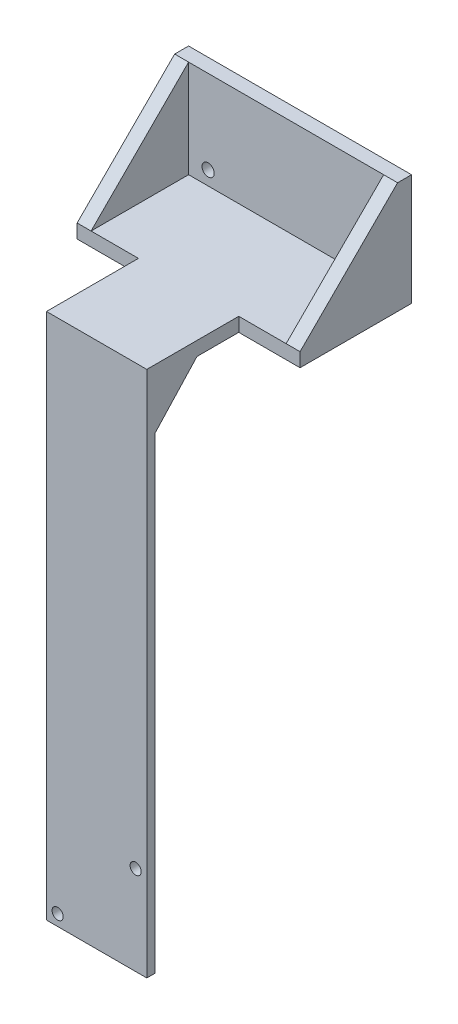
ISO-10303-21;
HEADER;
FILE_DESCRIPTION(('STEP AP214'),'2;1');
FILE_NAME('part.step','',(''),(''),'','','');
FILE_SCHEMA(('AUTOMOTIVE_DESIGN { 1 0 10303 214 1 1 1 1 }'));
ENDSEC;
DATA;
#1=APPLICATION_CONTEXT('core data for automotive mechanical design processes');
#2=APPLICATION_PROTOCOL_DEFINITION('international standard','automotive_design',2000,#1);
#3=PRODUCT_CONTEXT('',#1,'mechanical');
#4=PRODUCT('Part','Part','',(#3));
#5=PRODUCT_RELATED_PRODUCT_CATEGORY('part','',(#4));
#6=PRODUCT_DEFINITION_FORMATION('','',#4);
#7=PRODUCT_DEFINITION_CONTEXT('part definition',#1,'design');
#8=PRODUCT_DEFINITION('design','',#6,#7);
#9=PRODUCT_DEFINITION_SHAPE('','',#8);
#10=(LENGTH_UNIT() NAMED_UNIT(*) SI_UNIT(.MILLI.,.METRE.));
#11=(NAMED_UNIT(*) PLANE_ANGLE_UNIT() SI_UNIT($,.RADIAN.));
#12=(NAMED_UNIT(*) SI_UNIT($,.STERADIAN.) SOLID_ANGLE_UNIT());
#13=UNCERTAINTY_MEASURE_WITH_UNIT(LENGTH_MEASURE(1.E-05),#10,'distance_accuracy_value','');
#14=(GEOMETRIC_REPRESENTATION_CONTEXT(3) GLOBAL_UNCERTAINTY_ASSIGNED_CONTEXT((#13)) GLOBAL_UNIT_ASSIGNED_CONTEXT((#10,
#11,#12)) REPRESENTATION_CONTEXT('',''));
#15=CARTESIAN_POINT('',(0.,0.,0.));
#16=DIRECTION('',(0.,0.,1.));
#17=DIRECTION('',(1.,0.,0.));
#18=AXIS2_PLACEMENT_3D('',#15,#16,#17);
#19=CARTESIAN_POINT('',(-40.,5.,20.));
#20=DIRECTION('',(0.,0.,-1.));
#21=DIRECTION('',(-1.,0.,0.));
#22=AXIS2_PLACEMENT_3D('',#19,#20,#21);
#23=PLANE('',#22);
#24=DIRECTION('',(0.,-1.,0.));
#25=VECTOR('',#24,1.);
#26=CARTESIAN_POINT('',(-18.,5.,20.));
#27=LINE('',#26,#25);
#28=CARTESIAN_POINT('',(-18.,5.,20.));
#29=VERTEX_POINT('',#28);
#30=CARTESIAN_POINT('',(-18.,0.,20.));
#31=VERTEX_POINT('',#30);
#32=EDGE_CURVE('E180',#29,#31,#27,.T.);
#33=ORIENTED_EDGE('',*,*,#32,.F.);
#34=DIRECTION('',(1.,0.,0.));
#35=VECTOR('',#34,1.);
#36=CARTESIAN_POINT('',(-40.,5.,20.));
#37=LINE('',#36,#35);
#38=CARTESIAN_POINT('',(-35.,5.,20.));
#39=VERTEX_POINT('',#38);
#40=EDGE_CURVE('E295',#39,#29,#37,.T.);
#41=ORIENTED_EDGE('',*,*,#40,.F.);
#42=CARTESIAN_POINT('',(-40.,5.,20.));
#43=VERTEX_POINT('',#42);
#44=EDGE_CURVE('E291',#43,#39,#37,.T.);
#45=ORIENTED_EDGE('',*,*,#44,.F.);
#46=DIRECTION('',(0.,-1.,0.));
#47=VECTOR('',#46,1.);
#48=CARTESIAN_POINT('',(-40.,5.,20.));
#49=LINE('',#48,#47);
#50=CARTESIAN_POINT('',(-40.,0.,20.));
#51=VERTEX_POINT('',#50);
#52=EDGE_CURVE('E314',#43,#51,#49,.T.);
#53=ORIENTED_EDGE('',*,*,#52,.T.);
#54=DIRECTION('',(1.,0.,0.));
#55=VECTOR('',#54,1.);
#56=CARTESIAN_POINT('',(-40.,0.,20.));
#57=LINE('',#56,#55);
#58=EDGE_CURVE('E307',#51,#31,#57,.T.);
#59=ORIENTED_EDGE('',*,*,#58,.T.);
#60=EDGE_LOOP('',(#33,#41,#45,#53,#59));
#61=FACE_BOUND('',#60,.T.);
#62=ADVANCED_FACE('F45',(#61),#23,.F.);
#63=DIRECTION('',(0.,1.,0.));
#64=VECTOR('',#63,1.);
#65=CARTESIAN_POINT('',(18.,5.,20.));
#66=LINE('',#65,#64);
#67=CARTESIAN_POINT('',(18.,0.,20.));
#68=VERTEX_POINT('',#67);
#69=CARTESIAN_POINT('',(18.,5.,20.));
#70=VERTEX_POINT('',#69);
#71=EDGE_CURVE('E185',#68,#70,#66,.T.);
#72=ORIENTED_EDGE('',*,*,#71,.F.);
#73=CARTESIAN_POINT('',(40.,0.,20.));
#74=VERTEX_POINT('',#73);
#75=EDGE_CURVE('E306',#68,#74,#57,.T.);
#76=ORIENTED_EDGE('',*,*,#75,.T.);
#77=DIRECTION('',(0.,-1.,0.));
#78=VECTOR('',#77,1.);
#79=CARTESIAN_POINT('',(40.,5.,20.));
#80=LINE('',#79,#78);
#81=CARTESIAN_POINT('',(40.,5.,20.));
#82=VERTEX_POINT('',#81);
#83=EDGE_CURVE('E294',#82,#74,#80,.T.);
#84=ORIENTED_EDGE('',*,*,#83,.F.);
#85=DIRECTION('',(1.,0.,0.));
#86=VECTOR('',#85,1.);
#87=CARTESIAN_POINT('',(35.,5.,20.));
#88=LINE('',#87,#86);
#89=CARTESIAN_POINT('',(35.,5.,20.));
#90=VERTEX_POINT('',#89);
#91=EDGE_CURVE('E248',#90,#82,#88,.T.);
#92=ORIENTED_EDGE('',*,*,#91,.F.);
#93=EDGE_CURVE('E296',#70,#90,#37,.T.);
#94=ORIENTED_EDGE('',*,*,#93,.F.);
#95=EDGE_LOOP('',(#72,#76,#84,#92,#94));
#96=FACE_BOUND('',#95,.T.);
#97=ADVANCED_FACE('F351',(#96),#23,.F.);
#98=CARTESIAN_POINT('',(0.,5.,0.));
#99=DIRECTION('',(0.,-1.,0.));
#100=DIRECTION('',(0.,0.,-1.));
#101=AXIS2_PLACEMENT_3D('',#98,#99,#100);
#102=PLANE('',#101);
#103=ORIENTED_EDGE('',*,*,#40,.T.);
#104=DIRECTION('',(0.,0.,-1.));
#105=VECTOR('',#104,1.);
#106=CARTESIAN_POINT('',(-18.,5.,53.));
#107=LINE('',#106,#105);
#108=CARTESIAN_POINT('',(-18.,5.,53.));
#109=VERTEX_POINT('',#108);
#110=EDGE_CURVE('E198',#109,#29,#107,.T.);
#111=ORIENTED_EDGE('',*,*,#110,.F.);
#112=DIRECTION('',(-1.,0.,0.));
#113=VECTOR('',#112,1.);
#114=CARTESIAN_POINT('',(-18.,5.,53.));
#115=LINE('',#114,#113);
#116=CARTESIAN_POINT('',(18.,5.,53.));
#117=VERTEX_POINT('',#116);
#118=EDGE_CURVE('E196',#117,#109,#115,.T.);
#119=ORIENTED_EDGE('',*,*,#118,.F.);
#120=DIRECTION('',(0.,0.,-1.));
#121=VECTOR('',#120,1.);
#122=CARTESIAN_POINT('',(18.,5.,53.));
#123=LINE('',#122,#121);
#124=EDGE_CURVE('E206',#117,#70,#123,.T.);
#125=ORIENTED_EDGE('',*,*,#124,.T.);
#126=ORIENTED_EDGE('',*,*,#93,.T.);
#127=DIRECTION('',(0.,0.,-1.));
#128=VECTOR('',#127,1.);
#129=CARTESIAN_POINT('',(35.,5.,20.));
#130=LINE('',#129,#128);
#131=CARTESIAN_POINT('',(35.,5.,-15.));
#132=VERTEX_POINT('',#131);
#133=EDGE_CURVE('E240',#90,#132,#130,.T.);
#134=ORIENTED_EDGE('',*,*,#133,.T.);
#135=DIRECTION('',(1.,0.,0.));
#136=VECTOR('',#135,1.);
#137=CARTESIAN_POINT('',(40.,5.,-15.));
#138=LINE('',#137,#136);
#139=CARTESIAN_POINT('',(-35.,5.,-15.));
#140=VERTEX_POINT('',#139);
#141=EDGE_CURVE('E266',#140,#132,#138,.T.);
#142=ORIENTED_EDGE('',*,*,#141,.F.);
#143=DIRECTION('',(0.,0.,1.));
#144=VECTOR('',#143,1.);
#145=CARTESIAN_POINT('',(-35.,5.,20.));
#146=LINE('',#145,#144);
#147=EDGE_CURVE('E259',#140,#39,#146,.T.);
#148=ORIENTED_EDGE('',*,*,#147,.T.);
#149=EDGE_LOOP('',(#103,#111,#119,#125,#126,#134,#142,#148));
#150=FACE_BOUND('',#149,.T.);
#151=ADVANCED_FACE('F336',(#150),#102,.F.);
#152=CARTESIAN_POINT('',(40.,5.,20.));
#153=DIRECTION('',(-1.,0.,0.));
#154=DIRECTION('',(0.,0.,1.));
#155=AXIS2_PLACEMENT_3D('',#152,#153,#154);
#156=PLANE('',#155);
#157=DIRECTION('',(0.,0.,-1.));
#158=VECTOR('',#157,1.);
#159=CARTESIAN_POINT('',(40.,0.,20.));
#160=LINE('',#159,#158);
#161=CARTESIAN_POINT('',(40.,0.,-20.));
#162=VERTEX_POINT('',#161);
#163=EDGE_CURVE('E287',#74,#162,#160,.T.);
#164=ORIENTED_EDGE('',*,*,#163,.T.);
#165=DIRECTION('',(0.,-1.,0.));
#166=VECTOR('',#165,1.);
#167=CARTESIAN_POINT('',(40.,5.,-20.));
#168=LINE('',#167,#166);
#169=CARTESIAN_POINT('',(40.,40.,-20.));
#170=VERTEX_POINT('',#169);
#171=EDGE_CURVE('E11',#170,#162,#168,.T.);
#172=ORIENTED_EDGE('',*,*,#171,.F.);
#173=DIRECTION('',(0.,0.,-1.));
#174=VECTOR('',#173,1.);
#175=CARTESIAN_POINT('',(40.,40.,-20.));
#176=LINE('',#175,#174);
#177=CARTESIAN_POINT('',(40.,40.,-15.));
#178=VERTEX_POINT('',#177);
#179=EDGE_CURVE('E270',#178,#170,#176,.T.);
#180=ORIENTED_EDGE('',*,*,#179,.F.);
#181=DIRECTION('',(0.,-0.707106781186548,0.707106781186548));
#182=VECTOR('',#181,1.);
#183=CARTESIAN_POINT('',(40.,40.,-15.));
#184=LINE('',#183,#182);
#185=EDGE_CURVE('E220',#178,#82,#184,.T.);
#186=ORIENTED_EDGE('',*,*,#185,.T.);
#187=ORIENTED_EDGE('',*,*,#83,.T.);
#188=EDGE_LOOP('',(#164,#172,#180,#186,#187));
#189=FACE_BOUND('',#188,.T.);
#190=ADVANCED_FACE('F47',(#189),#156,.F.);
#191=CARTESIAN_POINT('',(-40.,5.,-20.));
#192=DIRECTION('',(0.,0.,1.));
#193=DIRECTION('',(1.,0.,0.));
#194=AXIS2_PLACEMENT_3D('',#191,#192,#193);
#195=PLANE('',#194);
#196=CARTESIAN_POINT('',(-28.,10.,-20.));
#197=DIRECTION('',(0.,0.,1.));
#198=DIRECTION('',(1.,0.,0.));
#199=AXIS2_PLACEMENT_3D('',#196,#197,#198);
#200=CIRCLE('',#199,2.2);
#201=CARTESIAN_POINT('',(-25.8,10.,-20.));
#202=VERTEX_POINT('',#201);
#203=EDGE_CURVE('E216',#202,#202,#200,.T.);
#204=ORIENTED_EDGE('',*,*,#203,.T.);
#205=EDGE_LOOP('',(#204));
#206=FACE_BOUND('',#205,.T.);
#207=CARTESIAN_POINT('',(28.,10.,-20.));
#208=DIRECTION('',(0.,0.,1.));
#209=DIRECTION('',(-1.,0.,0.));
#210=AXIS2_PLACEMENT_3D('',#207,#208,#209);
#211=CIRCLE('',#210,2.2);
#212=CARTESIAN_POINT('',(25.8,10.,-20.));
#213=VERTEX_POINT('',#212);
#214=EDGE_CURVE('E215',#213,#213,#211,.T.);
#215=ORIENTED_EDGE('',*,*,#214,.T.);
#216=EDGE_LOOP('',(#215));
#217=FACE_BOUND('',#216,.T.);
#218=DIRECTION('',(-1.,0.,0.));
#219=VECTOR('',#218,1.);
#220=CARTESIAN_POINT('',(-40.,0.,-20.));
#221=LINE('',#220,#219);
#222=CARTESIAN_POINT('',(-40.,0.,-20.));
#223=VERTEX_POINT('',#222);
#224=EDGE_CURVE('E300',#162,#223,#221,.T.);
#225=ORIENTED_EDGE('',*,*,#224,.T.);
#226=DIRECTION('',(0.,-1.,0.));
#227=VECTOR('',#226,1.);
#228=CARTESIAN_POINT('',(-40.,5.,-20.));
#229=LINE('',#228,#227);
#230=CARTESIAN_POINT('',(-40.,40.,-20.));
#231=VERTEX_POINT('',#230);
#232=EDGE_CURVE('E54',#231,#223,#229,.T.);
#233=ORIENTED_EDGE('',*,*,#232,.F.);
#234=DIRECTION('',(-1.,0.,0.));
#235=VECTOR('',#234,1.);
#236=CARTESIAN_POINT('',(40.,40.,-20.));
#237=LINE('',#236,#235);
#238=EDGE_CURVE('E274',#170,#231,#237,.T.);
#239=ORIENTED_EDGE('',*,*,#238,.F.);
#240=ORIENTED_EDGE('',*,*,#171,.T.);
#241=EDGE_LOOP('',(#225,#233,#239,#240));
#242=FACE_BOUND('',#241,.T.);
#243=ADVANCED_FACE('F368',(#206,#217,#242),#195,.F.);
#244=CARTESIAN_POINT('',(-40.,5.,20.));
#245=DIRECTION('',(1.,0.,0.));
#246=DIRECTION('',(0.,0.,-1.));
#247=AXIS2_PLACEMENT_3D('',#244,#245,#246);
#248=PLANE('',#247);
#249=ORIENTED_EDGE('',*,*,#52,.F.);
#250=DIRECTION('',(0.,0.707106781186548,-0.707106781186547));
#251=VECTOR('',#250,1.);
#252=CARTESIAN_POINT('',(-40.,40.,-15.));
#253=LINE('',#252,#251);
#254=CARTESIAN_POINT('',(-40.,40.,-15.));
#255=VERTEX_POINT('',#254);
#256=EDGE_CURVE('E251',#43,#255,#253,.T.);
#257=ORIENTED_EDGE('',*,*,#256,.T.);
#258=DIRECTION('',(0.,0.,1.));
#259=VECTOR('',#258,1.);
#260=CARTESIAN_POINT('',(-40.,40.,-20.));
#261=LINE('',#260,#259);
#262=EDGE_CURVE('E278',#231,#255,#261,.T.);
#263=ORIENTED_EDGE('',*,*,#262,.F.);
#264=ORIENTED_EDGE('',*,*,#232,.T.);
#265=DIRECTION('',(0.,0.,1.));
#266=VECTOR('',#265,1.);
#267=CARTESIAN_POINT('',(-40.,0.,20.));
#268=LINE('',#267,#266);
#269=EDGE_CURVE('E303',#223,#51,#268,.T.);
#270=ORIENTED_EDGE('',*,*,#269,.T.);
#271=EDGE_LOOP('',(#249,#257,#263,#264,#270));
#272=FACE_BOUND('',#271,.T.);
#273=ADVANCED_FACE('F323',(#272),#248,.F.);
#274=CARTESIAN_POINT('',(0.,0.,0.));
#275=DIRECTION('',(0.,-1.,0.));
#276=DIRECTION('',(0.,0.,-1.));
#277=AXIS2_PLACEMENT_3D('',#274,#275,#276);
#278=PLANE('',#277);
#279=DIRECTION('',(-1.,0.,0.));
#280=VECTOR('',#279,1.);
#281=CARTESIAN_POINT('',(18.,0.,35.));
#282=LINE('',#281,#280);
#283=CARTESIAN_POINT('',(18.,0.,35.));
#284=VERTEX_POINT('',#283);
#285=CARTESIAN_POINT('',(-18.,0.,35.));
#286=VERTEX_POINT('',#285);
#287=EDGE_CURVE('E61',#284,#286,#282,.T.);
#288=ORIENTED_EDGE('',*,*,#287,.T.);
#289=DIRECTION('',(0.,0.,-1.));
#290=VECTOR('',#289,1.);
#291=CARTESIAN_POINT('',(-18.,0.,53.));
#292=LINE('',#291,#290);
#293=EDGE_CURVE('E212',#286,#31,#292,.T.);
#294=ORIENTED_EDGE('',*,*,#293,.T.);
#295=ORIENTED_EDGE('',*,*,#58,.F.);
#296=ORIENTED_EDGE('',*,*,#269,.F.);
#297=ORIENTED_EDGE('',*,*,#224,.F.);
#298=ORIENTED_EDGE('',*,*,#163,.F.);
#299=ORIENTED_EDGE('',*,*,#75,.F.);
#300=DIRECTION('',(0.,0.,-1.));
#301=VECTOR('',#300,1.);
#302=CARTESIAN_POINT('',(18.,0.,53.));
#303=LINE('',#302,#301);
#304=EDGE_CURVE('E66',#284,#68,#303,.T.);
#305=ORIENTED_EDGE('',*,*,#304,.F.);
#306=EDGE_LOOP('',(#288,#294,#295,#296,#297,#298,#299,#305));
#307=FACE_BOUND('',#306,.T.);
#308=ADVANCED_FACE('F327',(#307),#278,.T.);
#309=CARTESIAN_POINT('',(40.,40.,-15.));
#310=DIRECTION('',(0.,0.,-1.));
#311=DIRECTION('',(-1.,0.,0.));
#312=AXIS2_PLACEMENT_3D('',#309,#310,#311);
#313=PLANE('',#312);
#314=CARTESIAN_POINT('',(-28.,10.,-15.));
#315=DIRECTION('',(0.,0.,1.));
#316=DIRECTION('',(1.,0.,0.));
#317=AXIS2_PLACEMENT_3D('',#314,#315,#316);
#318=CIRCLE('',#317,2.2);
#319=CARTESIAN_POINT('',(-25.8,10.,-15.));
#320=VERTEX_POINT('',#319);
#321=EDGE_CURVE('E221',#320,#320,#318,.T.);
#322=ORIENTED_EDGE('',*,*,#321,.F.);
#323=EDGE_LOOP('',(#322));
#324=FACE_BOUND('',#323,.T.);
#325=CARTESIAN_POINT('',(28.,10.,-15.));
#326=DIRECTION('',(0.,0.,1.));
#327=DIRECTION('',(-1.,0.,0.));
#328=AXIS2_PLACEMENT_3D('',#325,#326,#327);
#329=CIRCLE('',#328,2.2);
#330=CARTESIAN_POINT('',(25.8,10.,-15.));
#331=VERTEX_POINT('',#330);
#332=EDGE_CURVE('E225',#331,#331,#329,.T.);
#333=ORIENTED_EDGE('',*,*,#332,.F.);
#334=EDGE_LOOP('',(#333));
#335=FACE_BOUND('',#334,.T.);
#336=ORIENTED_EDGE('',*,*,#141,.T.);
#337=DIRECTION('',(0.,1.,0.));
#338=VECTOR('',#337,1.);
#339=CARTESIAN_POINT('',(35.,5.,-15.));
#340=LINE('',#339,#338);
#341=CARTESIAN_POINT('',(35.,40.,-15.));
#342=VERTEX_POINT('',#341);
#343=EDGE_CURVE('E232',#132,#342,#340,.T.);
#344=ORIENTED_EDGE('',*,*,#343,.T.);
#345=DIRECTION('',(1.,0.,0.));
#346=VECTOR('',#345,1.);
#347=CARTESIAN_POINT('',(40.,40.,-15.));
#348=LINE('',#347,#346);
#349=CARTESIAN_POINT('',(-35.,40.,-15.));
#350=VERTEX_POINT('',#349);
#351=EDGE_CURVE('E282',#350,#342,#348,.T.);
#352=ORIENTED_EDGE('',*,*,#351,.F.);
#353=DIRECTION('',(0.,-1.,0.));
#354=VECTOR('',#353,1.);
#355=CARTESIAN_POINT('',(-35.,40.,-15.));
#356=LINE('',#355,#354);
#357=EDGE_CURVE('E255',#350,#140,#356,.T.);
#358=ORIENTED_EDGE('',*,*,#357,.T.);
#359=EDGE_LOOP('',(#336,#344,#352,#358));
#360=FACE_BOUND('',#359,.T.);
#361=ADVANCED_FACE('F361',(#324,#335,#360),#313,.F.);
#362=CARTESIAN_POINT('',(0.,40.,0.));
#363=DIRECTION('',(0.,-1.,0.));
#364=DIRECTION('',(0.,0.,-1.));
#365=AXIS2_PLACEMENT_3D('',#362,#363,#364);
#366=PLANE('',#365);
#367=ORIENTED_EDGE('',*,*,#179,.T.);
#368=ORIENTED_EDGE('',*,*,#238,.T.);
#369=ORIENTED_EDGE('',*,*,#262,.T.);
#370=EDGE_CURVE('E283',#255,#350,#348,.T.);
#371=ORIENTED_EDGE('',*,*,#370,.T.);
#372=ORIENTED_EDGE('',*,*,#351,.T.);
#373=DIRECTION('',(1.,0.,0.));
#374=VECTOR('',#373,1.);
#375=CARTESIAN_POINT('',(35.,40.,-15.));
#376=LINE('',#375,#374);
#377=EDGE_CURVE('E244',#342,#178,#376,.T.);
#378=ORIENTED_EDGE('',*,*,#377,.T.);
#379=EDGE_LOOP('',(#367,#368,#369,#371,#372,#378));
#380=FACE_BOUND('',#379,.T.);
#381=ADVANCED_FACE('F359',(#380),#366,.F.);
#382=CARTESIAN_POINT('',(-35.,40.,-15.));
#383=DIRECTION('',(0.,0.707106781186547,0.707106781186548));
#384=DIRECTION('',(0.,-0.707106781186548,0.707106781186547));
#385=AXIS2_PLACEMENT_3D('',#382,#383,#384);
#386=PLANE('',#385);
#387=ORIENTED_EDGE('',*,*,#256,.F.);
#388=ORIENTED_EDGE('',*,*,#44,.T.);
#389=DIRECTION('',(0.,0.707106781186548,-0.707106781186547));
#390=VECTOR('',#389,1.);
#391=CARTESIAN_POINT('',(-35.,40.,-15.));
#392=LINE('',#391,#390);
#393=EDGE_CURVE('E263',#39,#350,#392,.T.);
#394=ORIENTED_EDGE('',*,*,#393,.T.);
#395=ORIENTED_EDGE('',*,*,#370,.F.);
#396=EDGE_LOOP('',(#387,#388,#394,#395));
#397=FACE_BOUND('',#396,.T.);
#398=ADVANCED_FACE('F367',(#397),#386,.T.);
#399=CARTESIAN_POINT('',(-35.,0.,0.));
#400=DIRECTION('',(1.,0.,0.));
#401=DIRECTION('',(0.,0.,-1.));
#402=AXIS2_PLACEMENT_3D('',#399,#400,#401);
#403=PLANE('',#402);
#404=ORIENTED_EDGE('',*,*,#357,.F.);
#405=ORIENTED_EDGE('',*,*,#393,.F.);
#406=ORIENTED_EDGE('',*,*,#147,.F.);
#407=EDGE_LOOP('',(#404,#405,#406));
#408=FACE_BOUND('',#407,.T.);
#409=ADVANCED_FACE('F365',(#408),#403,.T.);
#410=CARTESIAN_POINT('',(35.,40.,-15.));
#411=DIRECTION('',(0.,0.707106781186548,0.707106781186548));
#412=DIRECTION('',(0.,-0.707106781186548,0.707106781186548));
#413=AXIS2_PLACEMENT_3D('',#410,#411,#412);
#414=PLANE('',#413);
#415=ORIENTED_EDGE('',*,*,#185,.F.);
#416=ORIENTED_EDGE('',*,*,#377,.F.);
#417=DIRECTION('',(0.,-0.707106781186548,0.707106781186548));
#418=VECTOR('',#417,1.);
#419=CARTESIAN_POINT('',(35.,40.,-15.));
#420=LINE('',#419,#418);
#421=EDGE_CURVE('E236',#342,#90,#420,.T.);
#422=ORIENTED_EDGE('',*,*,#421,.T.);
#423=ORIENTED_EDGE('',*,*,#91,.T.);
#424=EDGE_LOOP('',(#415,#416,#422,#423));
#425=FACE_BOUND('',#424,.T.);
#426=ADVANCED_FACE('F347',(#425),#414,.T.);
#427=CARTESIAN_POINT('',(35.,0.,0.));
#428=DIRECTION('',(-1.,0.,0.));
#429=DIRECTION('',(0.,0.,1.));
#430=AXIS2_PLACEMENT_3D('',#427,#428,#429);
#431=PLANE('',#430);
#432=ORIENTED_EDGE('',*,*,#343,.F.);
#433=ORIENTED_EDGE('',*,*,#133,.F.);
#434=ORIENTED_EDGE('',*,*,#421,.F.);
#435=EDGE_LOOP('',(#432,#433,#434));
#436=FACE_BOUND('',#435,.T.);
#437=ADVANCED_FACE('F349',(#436),#431,.T.);
#438=CARTESIAN_POINT('',(28.,10.,-20.));
#439=DIRECTION('',(0.,0.,1.));
#440=DIRECTION('',(1.,0.,0.));
#441=AXIS2_PLACEMENT_3D('',#438,#439,#440);
#442=CYLINDRICAL_SURFACE('',#441,2.2);
#443=ORIENTED_EDGE('',*,*,#214,.F.);
#444=EDGE_LOOP('',(#443));
#445=FACE_BOUND('',#444,.T.);
#446=ORIENTED_EDGE('',*,*,#332,.T.);
#447=EDGE_LOOP('',(#446));
#448=FACE_BOUND('',#447,.T.);
#449=ADVANCED_FACE('F401',(#445,#448),#442,.F.);
#450=CARTESIAN_POINT('',(-28.,10.,-20.));
#451=DIRECTION('',(0.,0.,1.));
#452=DIRECTION('',(1.,0.,0.));
#453=AXIS2_PLACEMENT_3D('',#450,#451,#452);
#454=CYLINDRICAL_SURFACE('',#453,2.2);
#455=ORIENTED_EDGE('',*,*,#203,.F.);
#456=EDGE_LOOP('',(#455));
#457=FACE_BOUND('',#456,.T.);
#458=ORIENTED_EDGE('',*,*,#321,.T.);
#459=EDGE_LOOP('',(#458));
#460=FACE_BOUND('',#459,.T.);
#461=ADVANCED_FACE('F404',(#457,#460),#454,.F.);
#462=CARTESIAN_POINT('',(-18.,5.,53.));
#463=DIRECTION('',(1.,0.,0.));
#464=DIRECTION('',(0.,0.,-1.));
#465=AXIS2_PLACEMENT_3D('',#462,#463,#464);
#466=PLANE('',#465);
#467=ORIENTED_EDGE('',*,*,#293,.F.);
#468=DIRECTION('',(0.,-0.734710261171764,0.67838103756585));
#469=VECTOR('',#468,1.);
#470=CARTESIAN_POINT('',(-18.,0.,35.));
#471=LINE('',#470,#469);
#472=CARTESIAN_POINT('',(-18.,-16.2455217750787,50.));
#473=VERTEX_POINT('',#472);
#474=EDGE_CURVE('E178',#286,#473,#471,.T.);
#475=ORIENTED_EDGE('',*,*,#474,.T.);
#476=DIRECTION('',(0.,1.,0.));
#477=VECTOR('',#476,1.);
#478=CARTESIAN_POINT('',(-18.,-184.15,50.));
#479=LINE('',#478,#477);
#480=CARTESIAN_POINT('',(-18.,-184.15,50.));
#481=VERTEX_POINT('',#480);
#482=EDGE_CURVE('E154',#481,#473,#479,.T.);
#483=ORIENTED_EDGE('',*,*,#482,.F.);
#484=DIRECTION('',(0.,0.,-1.));
#485=VECTOR('',#484,1.);
#486=CARTESIAN_POINT('',(-18.,-184.15,53.));
#487=LINE('',#486,#485);
#488=CARTESIAN_POINT('',(-18.,-184.15,53.));
#489=VERTEX_POINT('',#488);
#490=EDGE_CURVE('E163',#489,#481,#487,.T.);
#491=ORIENTED_EDGE('',*,*,#490,.F.);
#492=DIRECTION('',(0.,-1.,0.));
#493=VECTOR('',#492,1.);
#494=CARTESIAN_POINT('',(-18.,5.,53.));
#495=LINE('',#494,#493);
#496=EDGE_CURVE('E190',#109,#489,#495,.T.);
#497=ORIENTED_EDGE('',*,*,#496,.F.);
#498=ORIENTED_EDGE('',*,*,#110,.T.);
#499=ORIENTED_EDGE('',*,*,#32,.T.);
#500=EDGE_LOOP('',(#467,#475,#483,#491,#497,#498,#499));
#501=FACE_BOUND('',#500,.T.);
#502=ADVANCED_FACE('F176',(#501),#466,.F.);
#503=CARTESIAN_POINT('',(18.,5.,53.));
#504=DIRECTION('',(-1.,0.,0.));
#505=DIRECTION('',(0.,-1.,0.));
#506=AXIS2_PLACEMENT_3D('',#503,#504,#505);
#507=PLANE('',#506);
#508=DIRECTION('',(0.,-0.734710261171764,0.67838103756585));
#509=VECTOR('',#508,1.);
#510=CARTESIAN_POINT('',(18.,0.,35.));
#511=LINE('',#510,#509);
#512=CARTESIAN_POINT('',(18.,-16.2455217750787,50.));
#513=VERTEX_POINT('',#512);
#514=EDGE_CURVE('E456',#284,#513,#511,.T.);
#515=ORIENTED_EDGE('',*,*,#514,.F.);
#516=ORIENTED_EDGE('',*,*,#304,.T.);
#517=ORIENTED_EDGE('',*,*,#71,.T.);
#518=ORIENTED_EDGE('',*,*,#124,.F.);
#519=DIRECTION('',(0.,1.,0.));
#520=VECTOR('',#519,1.);
#521=CARTESIAN_POINT('',(18.,5.,53.));
#522=LINE('',#521,#520);
#523=CARTESIAN_POINT('',(18.,-184.15,53.));
#524=VERTEX_POINT('',#523);
#525=EDGE_CURVE('E193',#524,#117,#522,.T.);
#526=ORIENTED_EDGE('',*,*,#525,.F.);
#527=DIRECTION('',(0.,0.,1.));
#528=VECTOR('',#527,1.);
#529=CARTESIAN_POINT('',(18.,-184.15,53.));
#530=LINE('',#529,#528);
#531=CARTESIAN_POINT('',(18.,-184.15,50.));
#532=VERTEX_POINT('',#531);
#533=EDGE_CURVE('E162',#532,#524,#530,.T.);
#534=ORIENTED_EDGE('',*,*,#533,.F.);
#535=DIRECTION('',(0.,1.,0.));
#536=VECTOR('',#535,1.);
#537=CARTESIAN_POINT('',(18.,-184.15,50.));
#538=LINE('',#537,#536);
#539=EDGE_CURVE('E157',#532,#513,#538,.T.);
#540=ORIENTED_EDGE('',*,*,#539,.T.);
#541=EDGE_LOOP('',(#515,#516,#517,#518,#526,#534,#540));
#542=FACE_BOUND('',#541,.T.);
#543=ADVANCED_FACE('F410',(#542),#507,.F.);
#544=CARTESIAN_POINT('',(0.,0.,53.));
#545=DIRECTION('',(0.,0.,1.));
#546=DIRECTION('',(1.,0.,0.));
#547=AXIS2_PLACEMENT_3D('',#544,#545,#546);
#548=PLANE('',#547);
#549=CARTESIAN_POINT('',(14.,-152.15,53.));
#550=DIRECTION('',(0.,0.,1.));
#551=DIRECTION('',(1.,0.,0.));
#552=AXIS2_PLACEMENT_3D('',#549,#550,#551);
#553=CIRCLE('',#552,2.00000000000001);
#554=CARTESIAN_POINT('',(16.,-152.15,53.));
#555=VERTEX_POINT('',#554);
#556=EDGE_CURVE('E442',#555,#555,#553,.T.);
#557=ORIENTED_EDGE('',*,*,#556,.F.);
#558=EDGE_LOOP('',(#557));
#559=FACE_BOUND('',#558,.T.);
#560=CARTESIAN_POINT('',(-14.,-180.15,53.));
#561=DIRECTION('',(0.,0.,1.));
#562=DIRECTION('',(-1.,0.,0.));
#563=AXIS2_PLACEMENT_3D('',#560,#561,#562);
#564=CIRCLE('',#563,2.);
#565=CARTESIAN_POINT('',(-16.,-180.15,53.));
#566=VERTEX_POINT('',#565);
#567=EDGE_CURVE('E444',#566,#566,#564,.T.);
#568=ORIENTED_EDGE('',*,*,#567,.F.);
#569=EDGE_LOOP('',(#568));
#570=FACE_BOUND('',#569,.T.);
#571=ORIENTED_EDGE('',*,*,#496,.T.);
#572=DIRECTION('',(-1.,0.,0.));
#573=VECTOR('',#572,1.);
#574=CARTESIAN_POINT('',(-18.,-184.15,53.));
#575=LINE('',#574,#573);
#576=EDGE_CURVE('E169',#524,#489,#575,.T.);
#577=ORIENTED_EDGE('',*,*,#576,.F.);
#578=ORIENTED_EDGE('',*,*,#525,.T.);
#579=ORIENTED_EDGE('',*,*,#118,.T.);
#580=EDGE_LOOP('',(#571,#577,#578,#579));
#581=FACE_BOUND('',#580,.T.);
#582=ADVANCED_FACE('F413',(#559,#570,#581),#548,.T.);
#583=CARTESIAN_POINT('',(-18.,-184.15,50.));
#584=DIRECTION('',(0.,0.,1.));
#585=DIRECTION('',(1.,0.,0.));
#586=AXIS2_PLACEMENT_3D('',#583,#584,#585);
#587=PLANE('',#586);
#588=CARTESIAN_POINT('',(14.,-152.15,50.));
#589=DIRECTION('',(0.,0.,1.));
#590=DIRECTION('',(1.,0.,0.));
#591=AXIS2_PLACEMENT_3D('',#588,#589,#590);
#592=CIRCLE('',#591,2.00000000000001);
#593=CARTESIAN_POINT('',(16.,-152.15,50.));
#594=VERTEX_POINT('',#593);
#595=EDGE_CURVE('E439',#594,#594,#592,.T.);
#596=ORIENTED_EDGE('',*,*,#595,.T.);
#597=EDGE_LOOP('',(#596));
#598=FACE_BOUND('',#597,.T.);
#599=CARTESIAN_POINT('',(-14.,-180.15,50.));
#600=DIRECTION('',(0.,0.,1.));
#601=DIRECTION('',(-1.,0.,0.));
#602=AXIS2_PLACEMENT_3D('',#599,#600,#601);
#603=CIRCLE('',#602,2.);
#604=CARTESIAN_POINT('',(-16.,-180.15,50.));
#605=VERTEX_POINT('',#604);
#606=EDGE_CURVE('E450',#605,#605,#603,.T.);
#607=ORIENTED_EDGE('',*,*,#606,.T.);
#608=EDGE_LOOP('',(#607));
#609=FACE_BOUND('',#608,.T.);
#610=ORIENTED_EDGE('',*,*,#482,.T.);
#611=DIRECTION('',(-1.,0.,0.));
#612=VECTOR('',#611,1.);
#613=CARTESIAN_POINT('',(18.,-16.2455217750787,50.));
#614=LINE('',#613,#612);
#615=EDGE_CURVE('E173',#513,#473,#614,.T.);
#616=ORIENTED_EDGE('',*,*,#615,.F.);
#617=ORIENTED_EDGE('',*,*,#539,.F.);
#618=DIRECTION('',(1.,0.,0.));
#619=VECTOR('',#618,1.);
#620=CARTESIAN_POINT('',(-18.,-184.15,50.));
#621=LINE('',#620,#619);
#622=EDGE_CURVE('E150',#481,#532,#621,.T.);
#623=ORIENTED_EDGE('',*,*,#622,.F.);
#624=EDGE_LOOP('',(#610,#616,#617,#623));
#625=FACE_BOUND('',#624,.T.);
#626=ADVANCED_FACE('F152',(#598,#609,#625),#587,.F.);
#627=CARTESIAN_POINT('',(0.,-184.15,0.));
#628=DIRECTION('',(0.,-1.,0.));
#629=DIRECTION('',(0.,0.,-1.));
#630=AXIS2_PLACEMENT_3D('',#627,#628,#629);
#631=PLANE('',#630);
#632=ORIENTED_EDGE('',*,*,#490,.T.);
#633=ORIENTED_EDGE('',*,*,#622,.T.);
#634=ORIENTED_EDGE('',*,*,#533,.T.);
#635=ORIENTED_EDGE('',*,*,#576,.T.);
#636=EDGE_LOOP('',(#632,#633,#634,#635));
#637=FACE_BOUND('',#636,.T.);
#638=ADVANCED_FACE('F167',(#637),#631,.T.);
#639=CARTESIAN_POINT('',(18.,0.,35.));
#640=DIRECTION('',(0.,-0.67838103756585,-0.734710261171764));
#641=DIRECTION('',(0.,0.734710261171764,-0.67838103756585));
#642=AXIS2_PLACEMENT_3D('',#639,#640,#641);
#643=PLANE('',#642);
#644=ORIENTED_EDGE('',*,*,#474,.F.);
#645=ORIENTED_EDGE('',*,*,#287,.F.);
#646=ORIENTED_EDGE('',*,*,#514,.T.);
#647=ORIENTED_EDGE('',*,*,#615,.T.);
#648=EDGE_LOOP('',(#644,#645,#646,#647));
#649=FACE_BOUND('',#648,.T.);
#650=ADVANCED_FACE('F423',(#649),#643,.T.);
#651=CARTESIAN_POINT('',(-14.,-180.15,50.));
#652=DIRECTION('',(0.,0.,1.));
#653=DIRECTION('',(1.,0.,0.));
#654=AXIS2_PLACEMENT_3D('',#651,#652,#653);
#655=CYLINDRICAL_SURFACE('',#654,2.);
#656=ORIENTED_EDGE('',*,*,#606,.F.);
#657=EDGE_LOOP('',(#656));
#658=FACE_BOUND('',#657,.T.);
#659=ORIENTED_EDGE('',*,*,#567,.T.);
#660=EDGE_LOOP('',(#659));
#661=FACE_BOUND('',#660,.T.);
#662=ADVANCED_FACE('F426',(#658,#661),#655,.F.);
#663=CARTESIAN_POINT('',(14.,-152.15,50.));
#664=DIRECTION('',(0.,0.,1.));
#665=DIRECTION('',(1.,0.,0.));
#666=AXIS2_PLACEMENT_3D('',#663,#664,#665);
#667=CYLINDRICAL_SURFACE('',#666,2.00000000000001);
#668=ORIENTED_EDGE('',*,*,#595,.F.);
#669=EDGE_LOOP('',(#668));
#670=FACE_BOUND('',#669,.T.);
#671=ORIENTED_EDGE('',*,*,#556,.T.);
#672=EDGE_LOOP('',(#671));
#673=FACE_BOUND('',#672,.T.);
#674=ADVANCED_FACE('F430',(#670,#673),#667,.F.);
#675=CLOSED_SHELL('',(#62,#97,#151,#190,#243,#273,#308,#361,#381,#398,#409,#426,#437,#449,#461,
#502,#543,#582,#626,#638,#650,#662,#674));
#676=MANIFOLD_SOLID_BREP('B2',#675);
#677=ADVANCED_BREP_SHAPE_REPRESENTATION('',(#18,#676),#14);
#678=SHAPE_DEFINITION_REPRESENTATION(#9,#677);
ENDSEC;
END-ISO-10303-21;
